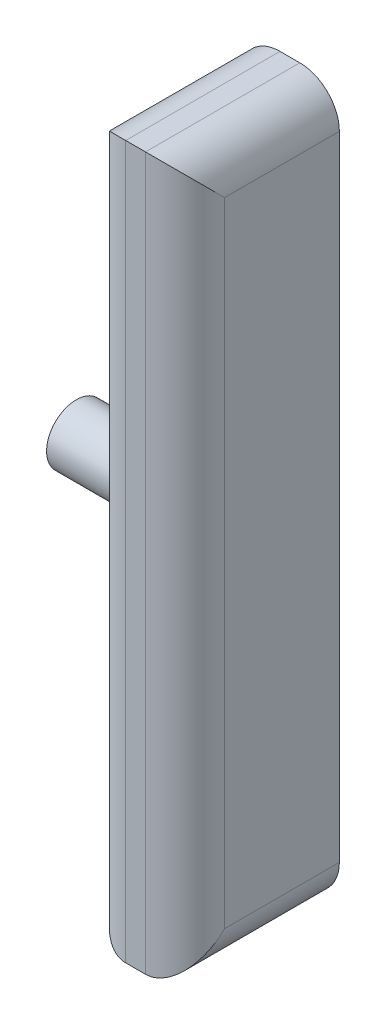
ISO-10303-21;
HEADER;
FILE_DESCRIPTION(('STEP AP214'),'2;1');
FILE_NAME('part.step','',(''),(''),'','','');
FILE_SCHEMA(('AUTOMOTIVE_DESIGN { 1 0 10303 214 1 1 1 1 }'));
ENDSEC;
DATA;
#1=APPLICATION_CONTEXT('core data for automotive mechanical design processes');
#2=APPLICATION_PROTOCOL_DEFINITION('international standard','automotive_design',2000,#1);
#3=PRODUCT_CONTEXT('',#1,'mechanical');
#4=PRODUCT('Part','Part','',(#3));
#5=PRODUCT_RELATED_PRODUCT_CATEGORY('part','',(#4));
#6=PRODUCT_DEFINITION_FORMATION('','',#4);
#7=PRODUCT_DEFINITION_CONTEXT('part definition',#1,'design');
#8=PRODUCT_DEFINITION('design','',#6,#7);
#9=PRODUCT_DEFINITION_SHAPE('','',#8);
#10=(LENGTH_UNIT() NAMED_UNIT(*) SI_UNIT(.MILLI.,.METRE.));
#11=(NAMED_UNIT(*) PLANE_ANGLE_UNIT() SI_UNIT($,.RADIAN.));
#12=(NAMED_UNIT(*) SI_UNIT($,.STERADIAN.) SOLID_ANGLE_UNIT());
#13=UNCERTAINTY_MEASURE_WITH_UNIT(LENGTH_MEASURE(1.E-05),#10,'distance_accuracy_value','');
#14=(GEOMETRIC_REPRESENTATION_CONTEXT(3) GLOBAL_UNCERTAINTY_ASSIGNED_CONTEXT((#13)) GLOBAL_UNIT_ASSIGNED_CONTEXT((#10,
#11,#12)) REPRESENTATION_CONTEXT('',''));
#15=CARTESIAN_POINT('',(0.,0.,0.));
#16=DIRECTION('',(0.,0.,1.));
#17=DIRECTION('',(1.,0.,0.));
#18=AXIS2_PLACEMENT_3D('',#15,#16,#17);
#19=CARTESIAN_POINT('',(22.,0.,0.));
#20=DIRECTION('',(-1.,0.,0.));
#21=DIRECTION('',(0.,0.,1.));
#22=AXIS2_PLACEMENT_3D('',#19,#20,#21);
#23=CYLINDRICAL_SURFACE('',#22,7.499999986);
#24=CARTESIAN_POINT('',(22.,0.,0.));
#25=DIRECTION('',(1.,0.,0.));
#26=DIRECTION('',(0.,0.,-1.));
#27=AXIS2_PLACEMENT_3D('',#24,#25,#26);
#28=CIRCLE('',#27,7.499999986);
#29=CARTESIAN_POINT('',(22.,0.,-7.499999986));
#30=VERTEX_POINT('',#29);
#31=EDGE_CURVE('E125',#30,#30,#28,.T.);
#32=ORIENTED_EDGE('',*,*,#31,.F.);
#33=EDGE_LOOP('',(#32));
#34=FACE_BOUND('',#33,.T.);
#35=CARTESIAN_POINT('',(0.,0.,0.));
#36=DIRECTION('',(1.,0.,0.));
#37=DIRECTION('',(0.,0.,-1.));
#38=AXIS2_PLACEMENT_3D('',#35,#36,#37);
#39=CIRCLE('',#38,7.499999986);
#40=CARTESIAN_POINT('',(0.,0.,-7.499999986));
#41=VERTEX_POINT('',#40);
#42=EDGE_CURVE('E160',#41,#41,#39,.T.);
#43=ORIENTED_EDGE('',*,*,#42,.T.);
#44=EDGE_LOOP('',(#43));
#45=FACE_BOUND('',#44,.T.);
#46=ADVANCED_FACE('F33',(#34,#45),#23,.T.);
#47=CARTESIAN_POINT('',(0.,0.,0.));
#48=DIRECTION('',(1.,0.,0.));
#49=DIRECTION('',(0.,0.,-1.));
#50=AXIS2_PLACEMENT_3D('',#47,#48,#49);
#51=PLANE('',#50);
#52=ORIENTED_EDGE('',*,*,#42,.F.);
#53=EDGE_LOOP('',(#52));
#54=FACE_BOUND('',#53,.T.);
#55=ADVANCED_FACE('F191',(#54),#51,.F.);
#56=CARTESIAN_POINT('',(22.,0.,0.));
#57=DIRECTION('',(1.,0.,0.));
#58=DIRECTION('',(0.,0.,-1.));
#59=AXIS2_PLACEMENT_3D('',#56,#57,#58);
#60=PLANE('',#59);
#61=DIRECTION('',(0.,-1.,0.));
#62=VECTOR('',#61,1.);
#63=CARTESIAN_POINT('',(22.,0.,9.5));
#64=LINE('',#63,#62);
#65=CARTESIAN_POINT('',(22.,-80.,9.50000000000001));
#66=VERTEX_POINT('',#65);
#67=CARTESIAN_POINT('',(22.,80.,9.5));
#68=VERTEX_POINT('',#67);
#69=EDGE_CURVE('E157',#66,#68,#64,.F.);
#70=ORIENTED_EDGE('',*,*,#69,.T.);
#71=DIRECTION('',(0.,0.,1.));
#72=VECTOR('',#71,1.);
#73=CARTESIAN_POINT('',(22.,80.,0.));
#74=LINE('',#73,#72);
#75=CARTESIAN_POINT('',(22.,80.,-19.5));
#76=VERTEX_POINT('',#75);
#77=EDGE_CURVE('E153',#68,#76,#74,.F.);
#78=ORIENTED_EDGE('',*,*,#77,.T.);
#79=DIRECTION('',(0.,1.,0.));
#80=VECTOR('',#79,1.);
#81=CARTESIAN_POINT('',(22.,90.,-19.5));
#82=LINE('',#81,#80);
#83=CARTESIAN_POINT('',(22.,-79.9999999999999,-19.5));
#84=VERTEX_POINT('',#83);
#85=EDGE_CURVE('E135',#84,#76,#82,.T.);
#86=ORIENTED_EDGE('',*,*,#85,.F.);
#87=DIRECTION('',(0.,0.,-1.));
#88=VECTOR('',#87,1.);
#89=CARTESIAN_POINT('',(22.,-80.,0.));
#90=LINE('',#89,#88);
#91=EDGE_CURVE('E155',#84,#66,#90,.F.);
#92=ORIENTED_EDGE('',*,*,#91,.T.);
#93=EDGE_LOOP('',(#70,#78,#86,#92));
#94=FACE_BOUND('',#93,.T.);
#95=ORIENTED_EDGE('',*,*,#31,.T.);
#96=EDGE_LOOP('',(#95));
#97=FACE_BOUND('',#96,.T.);
#98=ADVANCED_FACE('F197',(#94,#97),#60,.F.);
#99=CARTESIAN_POINT('',(47.,90.,19.5));
#100=DIRECTION('',(0.,0.,-1.));
#101=DIRECTION('',(0.,1.,0.));
#102=AXIS2_PLACEMENT_3D('',#99,#100,#101);
#103=PLANE('',#102);
#104=DIRECTION('',(-1.,0.,0.));
#105=VECTOR('',#104,1.);
#106=CARTESIAN_POINT('',(47.,-90.,19.5));
#107=LINE('',#106,#105);
#108=CARTESIAN_POINT('',(37.,-90.,19.5));
#109=VERTEX_POINT('',#108);
#110=CARTESIAN_POINT('',(32.,-90.,19.5));
#111=VERTEX_POINT('',#110);
#112=EDGE_CURVE('E101',#109,#111,#107,.T.);
#113=ORIENTED_EDGE('',*,*,#112,.F.);
#114=DIRECTION('',(0.,-1.,0.));
#115=VECTOR('',#114,1.);
#116=CARTESIAN_POINT('',(37.,90.,19.5));
#117=LINE('',#116,#115);
#118=CARTESIAN_POINT('',(37.,90.,19.5));
#119=VERTEX_POINT('',#118);
#120=EDGE_CURVE('E11',#109,#119,#117,.F.);
#121=ORIENTED_EDGE('',*,*,#120,.T.);
#122=DIRECTION('',(-1.,0.,0.));
#123=VECTOR('',#122,1.);
#124=CARTESIAN_POINT('',(47.,90.,19.5));
#125=LINE('',#124,#123);
#126=CARTESIAN_POINT('',(32.,90.,19.5));
#127=VERTEX_POINT('',#126);
#128=EDGE_CURVE('E100',#119,#127,#125,.T.);
#129=ORIENTED_EDGE('',*,*,#128,.T.);
#130=DIRECTION('',(0.,-1.,0.));
#131=VECTOR('',#130,1.);
#132=CARTESIAN_POINT('',(32.,90.,19.5));
#133=LINE('',#132,#131);
#134=EDGE_CURVE('E42',#127,#111,#133,.T.);
#135=ORIENTED_EDGE('',*,*,#134,.T.);
#136=EDGE_LOOP('',(#113,#121,#129,#135));
#137=FACE_BOUND('',#136,.T.);
#138=ADVANCED_FACE('F99',(#137),#103,.F.);
#139=CARTESIAN_POINT('',(47.,-90.,19.5));
#140=DIRECTION('',(0.,1.,0.));
#141=DIRECTION('',(0.,0.,1.));
#142=AXIS2_PLACEMENT_3D('',#139,#140,#141);
#143=PLANE('',#142);
#144=ORIENTED_EDGE('',*,*,#112,.T.);
#145=DIRECTION('',(0.,0.,-1.));
#146=VECTOR('',#145,1.);
#147=CARTESIAN_POINT('',(32.,-90.,19.5));
#148=LINE('',#147,#146);
#149=CARTESIAN_POINT('',(32.,-90.,-19.5));
#150=VERTEX_POINT('',#149);
#151=EDGE_CURVE('E138',#111,#150,#148,.T.);
#152=ORIENTED_EDGE('',*,*,#151,.T.);
#153=DIRECTION('',(-1.,0.,0.));
#154=VECTOR('',#153,1.);
#155=CARTESIAN_POINT('',(47.,-90.,-19.5));
#156=LINE('',#155,#154);
#157=CARTESIAN_POINT('',(37.,-90.,-19.5));
#158=VERTEX_POINT('',#157);
#159=EDGE_CURVE('E166',#158,#150,#156,.T.);
#160=ORIENTED_EDGE('',*,*,#159,.F.);
#161=DIRECTION('',(0.,0.,-1.));
#162=VECTOR('',#161,1.);
#163=CARTESIAN_POINT('',(37.,-90.,19.5));
#164=LINE('',#163,#162);
#165=EDGE_CURVE('E56',#158,#109,#164,.F.);
#166=ORIENTED_EDGE('',*,*,#165,.T.);
#167=EDGE_LOOP('',(#144,#152,#160,#166));
#168=FACE_BOUND('',#167,.T.);
#169=ADVANCED_FACE('F265',(#168),#143,.F.);
#170=CARTESIAN_POINT('',(47.,90.,-19.5));
#171=DIRECTION('',(0.,0.,1.));
#172=DIRECTION('',(0.,-1.,0.));
#173=AXIS2_PLACEMENT_3D('',#170,#171,#172);
#174=PLANE('',#173);
#175=ORIENTED_EDGE('',*,*,#85,.T.);
#176=CARTESIAN_POINT('',(32.,80.,-19.5));
#177=DIRECTION('',(0.,0.,1.));
#178=DIRECTION('',(0.,-1.,0.));
#179=AXIS2_PLACEMENT_3D('',#176,#177,#178);
#180=CIRCLE('',#179,10.);
#181=CARTESIAN_POINT('',(32.,90.,-19.5));
#182=VERTEX_POINT('',#181);
#183=EDGE_CURVE('E146',#76,#182,#180,.F.);
#184=ORIENTED_EDGE('',*,*,#183,.T.);
#185=DIRECTION('',(-1.,0.,0.));
#186=VECTOR('',#185,1.);
#187=CARTESIAN_POINT('',(47.,90.,-19.5));
#188=LINE('',#187,#186);
#189=CARTESIAN_POINT('',(37.,90.,-19.5));
#190=VERTEX_POINT('',#189);
#191=EDGE_CURVE('E115',#190,#182,#188,.T.);
#192=ORIENTED_EDGE('',*,*,#191,.F.);
#193=CARTESIAN_POINT('',(37.,80.,-19.5));
#194=DIRECTION('',(0.,0.,1.));
#195=DIRECTION('',(0.,-1.,0.));
#196=AXIS2_PLACEMENT_3D('',#193,#194,#195);
#197=CIRCLE('',#196,10.);
#198=CARTESIAN_POINT('',(47.,80.,-19.5));
#199=VERTEX_POINT('',#198);
#200=EDGE_CURVE('E124',#190,#199,#197,.F.);
#201=ORIENTED_EDGE('',*,*,#200,.T.);
#202=DIRECTION('',(0.,1.,0.));
#203=VECTOR('',#202,1.);
#204=CARTESIAN_POINT('',(47.,90.,-19.5));
#205=LINE('',#204,#203);
#206=CARTESIAN_POINT('',(47.,-79.9999999999999,-19.5));
#207=VERTEX_POINT('',#206);
#208=EDGE_CURVE('E116',#207,#199,#205,.T.);
#209=ORIENTED_EDGE('',*,*,#208,.F.);
#210=CARTESIAN_POINT('',(37.,-80.,-19.5));
#211=DIRECTION('',(0.,0.,1.));
#212=DIRECTION('',(0.,-1.,0.));
#213=AXIS2_PLACEMENT_3D('',#210,#211,#212);
#214=CIRCLE('',#213,10.);
#215=EDGE_CURVE('E151',#207,#158,#214,.F.);
#216=ORIENTED_EDGE('',*,*,#215,.T.);
#217=ORIENTED_EDGE('',*,*,#159,.T.);
#218=CARTESIAN_POINT('',(32.,-80.,-19.5));
#219=DIRECTION('',(0.,0.,1.));
#220=DIRECTION('',(0.,-1.,0.));
#221=AXIS2_PLACEMENT_3D('',#218,#219,#220);
#222=CIRCLE('',#221,10.);
#223=EDGE_CURVE('E149',#150,#84,#222,.F.);
#224=ORIENTED_EDGE('',*,*,#223,.T.);
#225=EDGE_LOOP('',(#175,#184,#192,#201,#209,#216,#217,#224));
#226=FACE_BOUND('',#225,.T.);
#227=ADVANCED_FACE('F179',(#226),#174,.F.);
#228=CARTESIAN_POINT('',(47.,90.,19.5));
#229=DIRECTION('',(0.,-1.,0.));
#230=DIRECTION('',(0.,0.,-1.));
#231=AXIS2_PLACEMENT_3D('',#228,#229,#230);
#232=PLANE('',#231);
#233=ORIENTED_EDGE('',*,*,#191,.T.);
#234=DIRECTION('',(0.,0.,1.));
#235=VECTOR('',#234,1.);
#236=CARTESIAN_POINT('',(32.,90.,19.5));
#237=LINE('',#236,#235);
#238=EDGE_CURVE('E114',#182,#127,#237,.T.);
#239=ORIENTED_EDGE('',*,*,#238,.T.);
#240=ORIENTED_EDGE('',*,*,#128,.F.);
#241=DIRECTION('',(0.,0.,1.));
#242=VECTOR('',#241,1.);
#243=CARTESIAN_POINT('',(37.,90.,-19.5));
#244=LINE('',#243,#242);
#245=EDGE_CURVE('E111',#119,#190,#244,.F.);
#246=ORIENTED_EDGE('',*,*,#245,.T.);
#247=EDGE_LOOP('',(#233,#239,#240,#246));
#248=FACE_BOUND('',#247,.T.);
#249=ADVANCED_FACE('F110',(#248),#232,.F.);
#250=CARTESIAN_POINT('',(47.,0.,0.));
#251=DIRECTION('',(1.,0.,0.));
#252=DIRECTION('',(0.,0.,-1.));
#253=AXIS2_PLACEMENT_3D('',#250,#251,#252);
#254=PLANE('',#253);
#255=ORIENTED_EDGE('',*,*,#208,.T.);
#256=DIRECTION('',(0.,0.,1.));
#257=VECTOR('',#256,1.);
#258=CARTESIAN_POINT('',(47.,80.,19.5));
#259=LINE('',#258,#257);
#260=CARTESIAN_POINT('',(47.,80.,9.5));
#261=VERTEX_POINT('',#260);
#262=EDGE_CURVE('E141',#199,#261,#259,.T.);
#263=ORIENTED_EDGE('',*,*,#262,.T.);
#264=DIRECTION('',(0.,-1.,0.));
#265=VECTOR('',#264,1.);
#266=CARTESIAN_POINT('',(47.,-90.,9.50000000000001));
#267=LINE('',#266,#265);
#268=CARTESIAN_POINT('',(47.,-80.,9.50000000000001));
#269=VERTEX_POINT('',#268);
#270=EDGE_CURVE('E128',#261,#269,#267,.T.);
#271=ORIENTED_EDGE('',*,*,#270,.T.);
#272=DIRECTION('',(0.,0.,-1.));
#273=VECTOR('',#272,1.);
#274=CARTESIAN_POINT('',(47.,-80.,-19.5));
#275=LINE('',#274,#273);
#276=EDGE_CURVE('E143',#269,#207,#275,.T.);
#277=ORIENTED_EDGE('',*,*,#276,.T.);
#278=EDGE_LOOP('',(#255,#263,#271,#277));
#279=FACE_BOUND('',#278,.T.);
#280=ADVANCED_FACE('F175',(#279),#254,.T.);
#281=CARTESIAN_POINT('',(32.,-80.,19.5));
#282=DIRECTION('',(0.,0.,-1.));
#283=DIRECTION('',(-1.,0.,0.));
#284=AXIS2_PLACEMENT_3D('',#281,#282,#283);
#285=CYLINDRICAL_SURFACE('',#284,10.);
#286=ORIENTED_EDGE('',*,*,#223,.F.);
#287=ORIENTED_EDGE('',*,*,#151,.F.);
#288=CARTESIAN_POINT('',(32.,-80.,9.50000000000001));
#289=DIRECTION('',(0.,-0.707106781186547,-0.707106781186547));
#290=DIRECTION('',(0.,-0.707106781186547,0.707106781186547));
#291=AXIS2_PLACEMENT_3D('',#288,#289,#290);
#292=ELLIPSE('',#291,14.1421356237309,10.);
#293=EDGE_CURVE('E132',#66,#111,#292,.F.);
#294=ORIENTED_EDGE('',*,*,#293,.F.);
#295=ORIENTED_EDGE('',*,*,#91,.F.);
#296=EDGE_LOOP('',(#286,#287,#294,#295));
#297=FACE_BOUND('',#296,.T.);
#298=ADVANCED_FACE('F206',(#297),#285,.T.);
#299=CARTESIAN_POINT('',(32.,90.,9.5));
#300=DIRECTION('',(0.,-1.,0.));
#301=DIRECTION('',(0.,0.,-1.));
#302=AXIS2_PLACEMENT_3D('',#299,#300,#301);
#303=CYLINDRICAL_SURFACE('',#302,10.);
#304=ORIENTED_EDGE('',*,*,#293,.T.);
#305=ORIENTED_EDGE('',*,*,#134,.F.);
#306=CARTESIAN_POINT('',(32.,80.,9.5));
#307=DIRECTION('',(0.,-0.707106781186547,0.707106781186547));
#308=DIRECTION('',(0.,-0.707106781186547,-0.707106781186547));
#309=AXIS2_PLACEMENT_3D('',#306,#307,#308);
#310=ELLIPSE('',#309,14.1421356237309,10.);
#311=EDGE_CURVE('E130',#68,#127,#310,.F.);
#312=ORIENTED_EDGE('',*,*,#311,.F.);
#313=ORIENTED_EDGE('',*,*,#69,.F.);
#314=EDGE_LOOP('',(#304,#305,#312,#313));
#315=FACE_BOUND('',#314,.T.);
#316=ADVANCED_FACE('F187',(#315),#303,.T.);
#317=CARTESIAN_POINT('',(32.,80.,19.5));
#318=DIRECTION('',(0.,0.,1.));
#319=DIRECTION('',(1.,0.,0.));
#320=AXIS2_PLACEMENT_3D('',#317,#318,#319);
#321=CYLINDRICAL_SURFACE('',#320,10.);
#322=ORIENTED_EDGE('',*,*,#183,.F.);
#323=ORIENTED_EDGE('',*,*,#77,.F.);
#324=ORIENTED_EDGE('',*,*,#311,.T.);
#325=ORIENTED_EDGE('',*,*,#238,.F.);
#326=EDGE_LOOP('',(#322,#323,#324,#325));
#327=FACE_BOUND('',#326,.T.);
#328=ADVANCED_FACE('F182',(#327),#321,.T.);
#329=CARTESIAN_POINT('',(37.,-80.,0.));
#330=DIRECTION('',(0.,0.,1.));
#331=DIRECTION('',(1.,0.,0.));
#332=AXIS2_PLACEMENT_3D('',#329,#330,#331);
#333=CYLINDRICAL_SURFACE('',#332,10.);
#334=ORIENTED_EDGE('',*,*,#215,.F.);
#335=ORIENTED_EDGE('',*,*,#276,.F.);
#336=CARTESIAN_POINT('',(37.,-80.,9.50000000000001));
#337=DIRECTION('',(0.,0.707106781186547,0.707106781186547));
#338=DIRECTION('',(0.,0.707106781186547,-0.707106781186547));
#339=AXIS2_PLACEMENT_3D('',#336,#337,#338);
#340=ELLIPSE('',#339,14.1421356237309,10.);
#341=EDGE_CURVE('E37',#109,#269,#340,.T.);
#342=ORIENTED_EDGE('',*,*,#341,.F.);
#343=ORIENTED_EDGE('',*,*,#165,.F.);
#344=EDGE_LOOP('',(#334,#335,#342,#343));
#345=FACE_BOUND('',#344,.T.);
#346=ADVANCED_FACE('F35',(#345),#333,.T.);
#347=CARTESIAN_POINT('',(37.,0.,9.5));
#348=DIRECTION('',(0.,1.,0.));
#349=DIRECTION('',(0.,0.,1.));
#350=AXIS2_PLACEMENT_3D('',#347,#348,#349);
#351=CYLINDRICAL_SURFACE('',#350,10.);
#352=ORIENTED_EDGE('',*,*,#341,.T.);
#353=ORIENTED_EDGE('',*,*,#270,.F.);
#354=CARTESIAN_POINT('',(37.,80.,9.5));
#355=DIRECTION('',(0.,0.707106781186547,-0.707106781186547));
#356=DIRECTION('',(0.,0.707106781186547,0.707106781186547));
#357=AXIS2_PLACEMENT_3D('',#354,#355,#356);
#358=ELLIPSE('',#357,14.1421356237309,10.);
#359=EDGE_CURVE('E122',#119,#261,#358,.T.);
#360=ORIENTED_EDGE('',*,*,#359,.F.);
#361=ORIENTED_EDGE('',*,*,#120,.F.);
#362=EDGE_LOOP('',(#352,#353,#360,#361));
#363=FACE_BOUND('',#362,.T.);
#364=ADVANCED_FACE('F127',(#363),#351,.T.);
#365=CARTESIAN_POINT('',(37.,80.,0.));
#366=DIRECTION('',(0.,0.,-1.));
#367=DIRECTION('',(-1.,0.,0.));
#368=AXIS2_PLACEMENT_3D('',#365,#366,#367);
#369=CYLINDRICAL_SURFACE('',#368,10.);
#370=ORIENTED_EDGE('',*,*,#200,.F.);
#371=ORIENTED_EDGE('',*,*,#245,.F.);
#372=ORIENTED_EDGE('',*,*,#359,.T.);
#373=ORIENTED_EDGE('',*,*,#262,.F.);
#374=EDGE_LOOP('',(#370,#371,#372,#373));
#375=FACE_BOUND('',#374,.T.);
#376=ADVANCED_FACE('F120',(#375),#369,.T.);
#377=CLOSED_SHELL('',(#46,#55,#98,#138,#169,#227,#249,#280,#298,#316,#328,#346,#364,#376));
#378=MANIFOLD_SOLID_BREP('B2',#377);
#379=ADVANCED_BREP_SHAPE_REPRESENTATION('',(#18,#378),#14);
#380=SHAPE_DEFINITION_REPRESENTATION(#9,#379);
ENDSEC;
END-ISO-10303-21;
